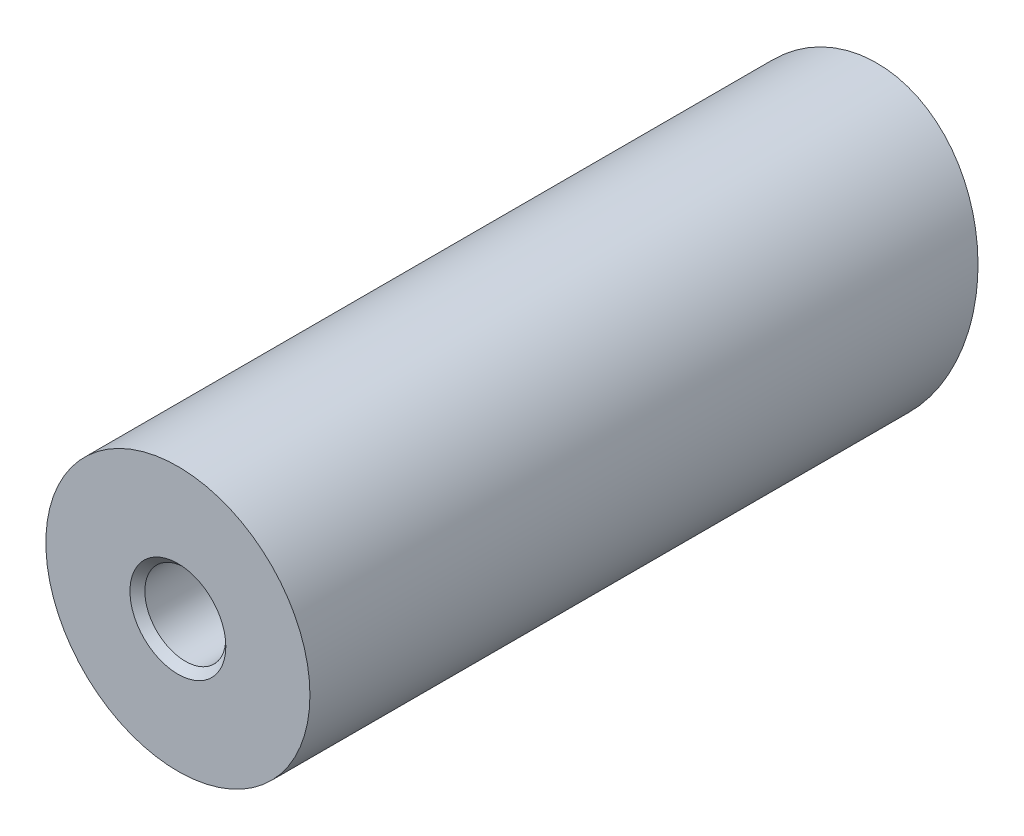
ISO-10303-21;
HEADER;
FILE_DESCRIPTION(('STEP AP214'),'2;1');
FILE_NAME('part.step','',(''),(''),'','','');
FILE_SCHEMA(('AUTOMOTIVE_DESIGN { 1 0 10303 214 1 1 1 1 }'));
ENDSEC;
DATA;
#1=APPLICATION_CONTEXT('core data for automotive mechanical design processes');
#2=APPLICATION_PROTOCOL_DEFINITION('international standard','automotive_design',2000,#1);
#3=PRODUCT_CONTEXT('',#1,'mechanical');
#4=PRODUCT('Part','Part','',(#3));
#5=PRODUCT_RELATED_PRODUCT_CATEGORY('part','',(#4));
#6=PRODUCT_DEFINITION_FORMATION('','',#4);
#7=PRODUCT_DEFINITION_CONTEXT('part definition',#1,'design');
#8=PRODUCT_DEFINITION('design','',#6,#7);
#9=PRODUCT_DEFINITION_SHAPE('','',#8);
#10=(LENGTH_UNIT() NAMED_UNIT(*) SI_UNIT(.MILLI.,.METRE.));
#11=(NAMED_UNIT(*) PLANE_ANGLE_UNIT() SI_UNIT($,.RADIAN.));
#12=(NAMED_UNIT(*) SI_UNIT($,.STERADIAN.) SOLID_ANGLE_UNIT());
#13=UNCERTAINTY_MEASURE_WITH_UNIT(LENGTH_MEASURE(1.E-05),#10,'distance_accuracy_value','');
#14=(GEOMETRIC_REPRESENTATION_CONTEXT(3) GLOBAL_UNCERTAINTY_ASSIGNED_CONTEXT((#13)) GLOBAL_UNIT_ASSIGNED_CONTEXT((#10,
#11,#12)) REPRESENTATION_CONTEXT('',''));
#15=CARTESIAN_POINT('',(0.,0.,0.));
#16=DIRECTION('',(0.,0.,1.));
#17=DIRECTION('',(1.,0.,0.));
#18=AXIS2_PLACEMENT_3D('',#15,#16,#17);
#19=CARTESIAN_POINT('',(0.,0.,0.));
#20=DIRECTION('',(0.,0.,-1.));
#21=DIRECTION('',(-1.,0.,0.));
#22=AXIS2_PLACEMENT_3D('',#19,#20,#21);
#23=PLANE('',#22);
#24=CARTESIAN_POINT('',(0.,0.,0.));
#25=DIRECTION('',(0.,0.,1.));
#26=DIRECTION('',(1.,0.,0.));
#27=AXIS2_PLACEMENT_3D('',#24,#25,#26);
#28=CIRCLE('',#27,4.025);
#29=CARTESIAN_POINT('',(4.025,0.,0.));
#30=VERTEX_POINT('',#29);
#31=EDGE_CURVE('E64',#30,#30,#28,.T.);
#32=ORIENTED_EDGE('',*,*,#31,.F.);
#33=EDGE_LOOP('',(#32));
#34=FACE_BOUND('',#33,.T.);
#35=CARTESIAN_POINT('',(0.,0.,0.));
#36=DIRECTION('',(0.,0.,1.));
#37=DIRECTION('',(1.,0.,0.));
#38=AXIS2_PLACEMENT_3D('',#35,#36,#37);
#39=CIRCLE('',#38,11.085593220339);
#40=CARTESIAN_POINT('',(11.085593220339,0.,0.));
#41=VERTEX_POINT('',#40);
#42=EDGE_CURVE('E11',#41,#41,#39,.T.);
#43=ORIENTED_EDGE('',*,*,#42,.T.);
#44=EDGE_LOOP('',(#43));
#45=FACE_BOUND('',#44,.T.);
#46=ADVANCED_FACE('F39',(#34,#45),#23,.F.);
#47=CARTESIAN_POINT('',(0.,0.,0.));
#48=DIRECTION('',(0.,0.,1.));
#49=DIRECTION('',(1.,0.,0.));
#50=AXIS2_PLACEMENT_3D('',#47,#48,#49);
#51=CYLINDRICAL_SURFACE('',#50,11.085593220339);
#52=ORIENTED_EDGE('',*,*,#42,.F.);
#53=EDGE_LOOP('',(#52));
#54=FACE_BOUND('',#53,.T.);
#55=CARTESIAN_POINT('',(0.,0.,-55.6945288114147));
#56=DIRECTION('',(0.,0.258819045102521,0.965925826289068));
#57=DIRECTION('',(0.,-0.965925826289068,0.258819045102521));
#58=AXIS2_PLACEMENT_3D('',#55,#56,#57);
#59=ELLIPSE('',#58,11.4766506067325,11.085593220339);
#60=CARTESIAN_POINT('',(0.,-11.085593220339,-52.7241530604049));
#61=VERTEX_POINT('',#60);
#62=EDGE_CURVE('E47',#61,#61,#59,.T.);
#63=ORIENTED_EDGE('',*,*,#62,.T.);
#64=EDGE_LOOP('',(#63));
#65=FACE_BOUND('',#64,.T.);
#66=ADVANCED_FACE('F77',(#54,#65),#51,.T.);
#67=CARTESIAN_POINT('',(-13.,11.085593220339,-58.6649045624244));
#68=DIRECTION('',(0.,0.258819045102521,0.965925826289068));
#69=DIRECTION('',(0.,-0.965925826289068,0.258819045102521));
#70=AXIS2_PLACEMENT_3D('',#67,#68,#69);
#71=PLANE('',#70);
#72=CARTESIAN_POINT('',(0.,0.,-55.6945288114147));
#73=DIRECTION('',(0.,0.258819045102521,0.965925826289068));
#74=DIRECTION('',(0.,0.965925826289068,-0.258819045102521));
#75=AXIS2_PLACEMENT_3D('',#72,#73,#74);
#76=ELLIPSE('',#75,3.51993901339427,3.39999999999999);
#77=CARTESIAN_POINT('',(0.,3.39999999999999,-56.6055560656805));
#78=VERTEX_POINT('',#77);
#79=EDGE_CURVE('E42',#78,#78,#76,.T.);
#80=ORIENTED_EDGE('',*,*,#79,.T.);
#81=EDGE_LOOP('',(#80));
#82=FACE_BOUND('',#81,.T.);
#83=ORIENTED_EDGE('',*,*,#62,.F.);
#84=EDGE_LOOP('',(#83));
#85=FACE_BOUND('',#84,.T.);
#86=ADVANCED_FACE('F79',(#82,#85),#71,.F.);
#87=CARTESIAN_POINT('',(0.,0.,-22.25));
#88=DIRECTION('',(0.,0.,1.));
#89=DIRECTION('',(1.,0.,0.));
#90=AXIS2_PLACEMENT_3D('',#87,#88,#89);
#91=CONICAL_SURFACE('',#90,3.4,1.02974425867665);
#92=CARTESIAN_POINT('',(0.,0.,-24.2929261046937));
#93=VERTEX_POINT('',#92);
#94=VERTEX_LOOP('',#93);
#95=FACE_BOUND('',#94,.T.);
#96=CARTESIAN_POINT('',(0.,0.,-22.25));
#97=DIRECTION('',(0.,0.,1.));
#98=DIRECTION('',(1.,0.,0.));
#99=AXIS2_PLACEMENT_3D('',#96,#97,#98);
#100=CIRCLE('',#99,3.4);
#101=CARTESIAN_POINT('',(3.4,0.,-22.25));
#102=VERTEX_POINT('',#101);
#103=EDGE_CURVE('E71',#102,#102,#100,.T.);
#104=ORIENTED_EDGE('',*,*,#103,.T.);
#105=EDGE_LOOP('',(#104));
#106=FACE_BOUND('',#105,.T.);
#107=ADVANCED_FACE('F81',(#95,#106),#91,.F.);
#108=CARTESIAN_POINT('',(0.,0.,0.));
#109=DIRECTION('',(0.,0.,1.));
#110=DIRECTION('',(1.,0.,0.));
#111=AXIS2_PLACEMENT_3D('',#108,#109,#110);
#112=CYLINDRICAL_SURFACE('',#111,3.4);
#113=ORIENTED_EDGE('',*,*,#103,.F.);
#114=EDGE_LOOP('',(#113));
#115=FACE_BOUND('',#114,.T.);
#116=CARTESIAN_POINT('',(0.,0.,-0.625000000000004));
#117=DIRECTION('',(0.,0.,1.));
#118=DIRECTION('',(1.,0.,0.));
#119=AXIS2_PLACEMENT_3D('',#116,#117,#118);
#120=CIRCLE('',#119,3.4);
#121=CARTESIAN_POINT('',(3.4,0.,-0.625000000000004));
#122=VERTEX_POINT('',#121);
#123=EDGE_CURVE('E68',#122,#122,#120,.T.);
#124=ORIENTED_EDGE('',*,*,#123,.T.);
#125=EDGE_LOOP('',(#124));
#126=FACE_BOUND('',#125,.T.);
#127=ADVANCED_FACE('F88',(#115,#126),#112,.F.);
#128=CARTESIAN_POINT('',(0.,0.,0.));
#129=DIRECTION('',(0.,0.,1.));
#130=DIRECTION('',(1.,0.,0.));
#131=AXIS2_PLACEMENT_3D('',#128,#129,#130);
#132=CONICAL_SURFACE('',#131,4.025,0.785398163397448);
#133=ORIENTED_EDGE('',*,*,#123,.F.);
#134=EDGE_LOOP('',(#133));
#135=FACE_BOUND('',#134,.T.);
#136=ORIENTED_EDGE('',*,*,#31,.T.);
#137=EDGE_LOOP('',(#136));
#138=FACE_BOUND('',#137,.T.);
#139=ADVANCED_FACE('F99',(#135,#138),#132,.F.);
#140=CARTESIAN_POINT('',(0.,0.,-58.6649045624244));
#141=DIRECTION('',(0.,0.,-1.));
#142=DIRECTION('',(-1.,0.,0.));
#143=AXIS2_PLACEMENT_3D('',#140,#141,#142);
#144=CYLINDRICAL_SURFACE('',#143,3.39999999999999);
#145=CARTESIAN_POINT('',(0.,0.,-36.4149045624244));
#146=DIRECTION('',(0.,0.,-1.));
#147=DIRECTION('',(-1.,0.,0.));
#148=AXIS2_PLACEMENT_3D('',#145,#146,#147);
#149=CIRCLE('',#148,3.39999999999999);
#150=CARTESIAN_POINT('',(-3.39999999999999,0.,-36.4149045624244));
#151=VERTEX_POINT('',#150);
#152=EDGE_CURVE('E60',#151,#151,#149,.T.);
#153=ORIENTED_EDGE('',*,*,#152,.F.);
#154=EDGE_LOOP('',(#153));
#155=FACE_BOUND('',#154,.T.);
#156=ORIENTED_EDGE('',*,*,#79,.F.);
#157=EDGE_LOOP('',(#156));
#158=FACE_BOUND('',#157,.T.);
#159=ADVANCED_FACE('F56',(#155,#158),#144,.F.);
#160=CARTESIAN_POINT('',(0.,0.,-36.4149045624244));
#161=DIRECTION('',(0.,0.,-1.));
#162=DIRECTION('',(-1.,0.,0.));
#163=AXIS2_PLACEMENT_3D('',#160,#161,#162);
#164=CONICAL_SURFACE('',#163,3.39999999999999,1.02974425867665);
#165=CARTESIAN_POINT('',(0.,0.,-34.3719784577307));
#166=VERTEX_POINT('',#165);
#167=VERTEX_LOOP('',#166);
#168=FACE_BOUND('',#167,.T.);
#169=ORIENTED_EDGE('',*,*,#152,.T.);
#170=EDGE_LOOP('',(#169));
#171=FACE_BOUND('',#170,.T.);
#172=ADVANCED_FACE('F53',(#168,#171),#164,.F.);
#173=CLOSED_SHELL('',(#46,#66,#86,#107,#127,#139,#159,#172));
#174=MANIFOLD_SOLID_BREP('B2',#173);
#175=ADVANCED_BREP_SHAPE_REPRESENTATION('',(#18,#174),#14);
#176=SHAPE_DEFINITION_REPRESENTATION(#9,#175);
ENDSEC;
END-ISO-10303-21;
